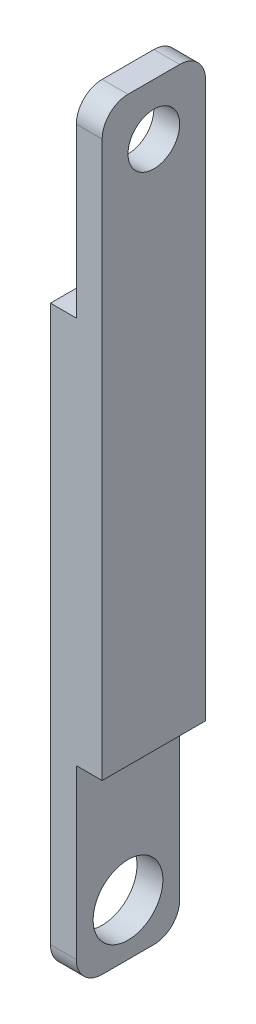
ISO-10303-21;
HEADER;
FILE_DESCRIPTION(('STEP AP214'),'2;1');
FILE_NAME('part.step','',(''),(''),'','','');
FILE_SCHEMA(('AUTOMOTIVE_DESIGN { 1 0 10303 214 1 1 1 1 }'));
ENDSEC;
DATA;
#1=APPLICATION_CONTEXT('core data for automotive mechanical design processes');
#2=APPLICATION_PROTOCOL_DEFINITION('international standard','automotive_design',2000,#1);
#3=PRODUCT_CONTEXT('',#1,'mechanical');
#4=PRODUCT('Part','Part','',(#3));
#5=PRODUCT_RELATED_PRODUCT_CATEGORY('part','',(#4));
#6=PRODUCT_DEFINITION_FORMATION('','',#4);
#7=PRODUCT_DEFINITION_CONTEXT('part definition',#1,'design');
#8=PRODUCT_DEFINITION('design','',#6,#7);
#9=PRODUCT_DEFINITION_SHAPE('','',#8);
#10=(LENGTH_UNIT() NAMED_UNIT(*) SI_UNIT(.MILLI.,.METRE.));
#11=(NAMED_UNIT(*) PLANE_ANGLE_UNIT() SI_UNIT($,.RADIAN.));
#12=(NAMED_UNIT(*) SI_UNIT($,.STERADIAN.) SOLID_ANGLE_UNIT());
#13=UNCERTAINTY_MEASURE_WITH_UNIT(LENGTH_MEASURE(1.E-05),#10,'distance_accuracy_value','');
#14=(GEOMETRIC_REPRESENTATION_CONTEXT(3) GLOBAL_UNCERTAINTY_ASSIGNED_CONTEXT((#13)) GLOBAL_UNIT_ASSIGNED_CONTEXT((#10,
#11,#12)) REPRESENTATION_CONTEXT('',''));
#15=CARTESIAN_POINT('',(0.,0.,0.));
#16=DIRECTION('',(0.,0.,1.));
#17=DIRECTION('',(1.,0.,0.));
#18=AXIS2_PLACEMENT_3D('',#15,#16,#17);
#19=CARTESIAN_POINT('',(20.,150.,20.));
#20=DIRECTION('',(0.,-1.,0.));
#21=DIRECTION('',(0.,0.,-1.));
#22=AXIS2_PLACEMENT_3D('',#19,#20,#21);
#23=PLANE('',#22);
#24=DIRECTION('',(0.,0.,1.));
#25=VECTOR('',#24,1.);
#26=CARTESIAN_POINT('',(20.,150.,20.));
#27=LINE('',#26,#25);
#28=CARTESIAN_POINT('',(20.,150.,-9.99999999999998));
#29=VERTEX_POINT('',#28);
#30=CARTESIAN_POINT('',(20.,150.,10.));
#31=VERTEX_POINT('',#30);
#32=EDGE_CURVE('E172',#29,#31,#27,.T.);
#33=ORIENTED_EDGE('',*,*,#32,.F.);
#34=DIRECTION('',(-1.,0.,0.));
#35=VECTOR('',#34,1.);
#36=CARTESIAN_POINT('',(20.,150.,-9.99999999999998));
#37=LINE('',#36,#35);
#38=CARTESIAN_POINT('',(10.,150.,-9.99999999999998));
#39=VERTEX_POINT('',#38);
#40=EDGE_CURVE('E205',#29,#39,#37,.T.);
#41=ORIENTED_EDGE('',*,*,#40,.T.);
#42=DIRECTION('',(0.,0.,-1.));
#43=VECTOR('',#42,1.);
#44=CARTESIAN_POINT('',(10.,150.,-20.));
#45=LINE('',#44,#43);
#46=CARTESIAN_POINT('',(10.,150.,10.));
#47=VERTEX_POINT('',#46);
#48=EDGE_CURVE('E160',#47,#39,#45,.T.);
#49=ORIENTED_EDGE('',*,*,#48,.F.);
#50=DIRECTION('',(-1.,0.,0.));
#51=VECTOR('',#50,1.);
#52=CARTESIAN_POINT('',(20.,150.,10.));
#53=LINE('',#52,#51);
#54=EDGE_CURVE('E47',#47,#31,#53,.F.);
#55=ORIENTED_EDGE('',*,*,#54,.T.);
#56=EDGE_LOOP('',(#33,#41,#49,#55));
#57=FACE_BOUND('',#56,.T.);
#58=ADVANCED_FACE('F32',(#57),#23,.F.);
#59=CARTESIAN_POINT('',(20.,150.,-20.));
#60=DIRECTION('',(0.,0.,1.));
#61=DIRECTION('',(0.,-1.,0.));
#62=AXIS2_PLACEMENT_3D('',#59,#60,#61);
#63=PLANE('',#62);
#64=DIRECTION('',(0.,1.,0.));
#65=VECTOR('',#64,1.);
#66=CARTESIAN_POINT('',(10.,-150.,-20.));
#67=LINE('',#66,#65);
#68=CARTESIAN_POINT('',(10.,-140.,-20.));
#69=VERTEX_POINT('',#68);
#70=CARTESIAN_POINT('',(10.,-75.,-20.));
#71=VERTEX_POINT('',#70);
#72=EDGE_CURVE('E121',#69,#71,#67,.T.);
#73=ORIENTED_EDGE('',*,*,#72,.F.);
#74=DIRECTION('',(-1.,0.,0.));
#75=VECTOR('',#74,1.);
#76=CARTESIAN_POINT('',(20.,-140.,-20.));
#77=LINE('',#76,#75);
#78=CARTESIAN_POINT('',(0.,-140.,-20.));
#79=VERTEX_POINT('',#78);
#80=EDGE_CURVE('E185',#69,#79,#77,.T.);
#81=ORIENTED_EDGE('',*,*,#80,.T.);
#82=DIRECTION('',(0.,1.,0.));
#83=VECTOR('',#82,1.);
#84=CARTESIAN_POINT('',(0.,150.,-20.));
#85=LINE('',#84,#83);
#86=CARTESIAN_POINT('',(0.,75.0000000000001,-20.));
#87=VERTEX_POINT('',#86);
#88=EDGE_CURVE('E168',#79,#87,#85,.T.);
#89=ORIENTED_EDGE('',*,*,#88,.T.);
#90=DIRECTION('',(-1.,0.,0.));
#91=VECTOR('',#90,1.);
#92=CARTESIAN_POINT('',(10.,75.0000000000001,-20.));
#93=LINE('',#92,#91);
#94=CARTESIAN_POINT('',(10.,75.0000000000001,-20.));
#95=VERTEX_POINT('',#94);
#96=EDGE_CURVE('E163',#95,#87,#93,.T.);
#97=ORIENTED_EDGE('',*,*,#96,.F.);
#98=DIRECTION('',(0.,-1.,0.));
#99=VECTOR('',#98,1.);
#100=CARTESIAN_POINT('',(10.,150.,-20.));
#101=LINE('',#100,#99);
#102=CARTESIAN_POINT('',(10.,140.,-20.));
#103=VERTEX_POINT('',#102);
#104=EDGE_CURVE('E152',#103,#95,#101,.T.);
#105=ORIENTED_EDGE('',*,*,#104,.F.);
#106=DIRECTION('',(-1.,0.,0.));
#107=VECTOR('',#106,1.);
#108=CARTESIAN_POINT('',(20.,140.,-20.));
#109=LINE('',#108,#107);
#110=CARTESIAN_POINT('',(20.,140.,-20.));
#111=VERTEX_POINT('',#110);
#112=EDGE_CURVE('E177',#103,#111,#109,.F.);
#113=ORIENTED_EDGE('',*,*,#112,.T.);
#114=DIRECTION('',(0.,1.,0.));
#115=VECTOR('',#114,1.);
#116=CARTESIAN_POINT('',(20.,150.,-20.));
#117=LINE('',#116,#115);
#118=CARTESIAN_POINT('',(20.,-75.,-20.));
#119=VERTEX_POINT('',#118);
#120=EDGE_CURVE('E146',#119,#111,#117,.T.);
#121=ORIENTED_EDGE('',*,*,#120,.F.);
#122=DIRECTION('',(1.,0.,0.));
#123=VECTOR('',#122,1.);
#124=CARTESIAN_POINT('',(10.,-75.,-20.));
#125=LINE('',#124,#123);
#126=EDGE_CURVE('E139',#71,#119,#125,.T.);
#127=ORIENTED_EDGE('',*,*,#126,.F.);
#128=EDGE_LOOP('',(#73,#81,#89,#97,#105,#113,#121,#127));
#129=FACE_BOUND('',#128,.T.);
#130=ADVANCED_FACE('F145',(#129),#63,.F.);
#131=CARTESIAN_POINT('',(20.,150.,20.));
#132=DIRECTION('',(0.,0.,-1.));
#133=DIRECTION('',(0.,1.,0.));
#134=AXIS2_PLACEMENT_3D('',#131,#132,#133);
#135=PLANE('',#134);
#136=DIRECTION('',(0.,-1.,0.));
#137=VECTOR('',#136,1.);
#138=CARTESIAN_POINT('',(0.,150.,20.));
#139=LINE('',#138,#137);
#140=CARTESIAN_POINT('',(0.,75.0000000000001,20.));
#141=VERTEX_POINT('',#140);
#142=CARTESIAN_POINT('',(0.,-140.,20.));
#143=VERTEX_POINT('',#142);
#144=EDGE_CURVE('E179',#141,#143,#139,.T.);
#145=ORIENTED_EDGE('',*,*,#144,.T.);
#146=DIRECTION('',(-1.,0.,0.));
#147=VECTOR('',#146,1.);
#148=CARTESIAN_POINT('',(20.,-140.,20.));
#149=LINE('',#148,#147);
#150=CARTESIAN_POINT('',(10.,-140.,20.));
#151=VERTEX_POINT('',#150);
#152=EDGE_CURVE('E202',#143,#151,#149,.F.);
#153=ORIENTED_EDGE('',*,*,#152,.T.);
#154=DIRECTION('',(0.,-1.,0.));
#155=VECTOR('',#154,1.);
#156=CARTESIAN_POINT('',(10.,-150.,20.));
#157=LINE('',#156,#155);
#158=CARTESIAN_POINT('',(10.,-75.,20.));
#159=VERTEX_POINT('',#158);
#160=EDGE_CURVE('E242',#159,#151,#157,.T.);
#161=ORIENTED_EDGE('',*,*,#160,.F.);
#162=DIRECTION('',(1.,0.,0.));
#163=VECTOR('',#162,1.);
#164=CARTESIAN_POINT('',(10.,-75.,20.));
#165=LINE('',#164,#163);
#166=CARTESIAN_POINT('',(20.,-75.,20.));
#167=VERTEX_POINT('',#166);
#168=EDGE_CURVE('E142',#159,#167,#165,.T.);
#169=ORIENTED_EDGE('',*,*,#168,.T.);
#170=DIRECTION('',(0.,-1.,0.));
#171=VECTOR('',#170,1.);
#172=CARTESIAN_POINT('',(20.,150.,20.));
#173=LINE('',#172,#171);
#174=CARTESIAN_POINT('',(20.,140.,20.));
#175=VERTEX_POINT('',#174);
#176=EDGE_CURVE('E175',#175,#167,#173,.T.);
#177=ORIENTED_EDGE('',*,*,#176,.F.);
#178=DIRECTION('',(-1.,0.,0.));
#179=VECTOR('',#178,1.);
#180=CARTESIAN_POINT('',(20.,140.,20.));
#181=LINE('',#180,#179);
#182=CARTESIAN_POINT('',(10.,140.,20.));
#183=VERTEX_POINT('',#182);
#184=EDGE_CURVE('E199',#175,#183,#181,.T.);
#185=ORIENTED_EDGE('',*,*,#184,.T.);
#186=DIRECTION('',(0.,1.,0.));
#187=VECTOR('',#186,1.);
#188=CARTESIAN_POINT('',(10.,150.,20.));
#189=LINE('',#188,#187);
#190=CARTESIAN_POINT('',(10.,75.0000000000001,20.));
#191=VERTEX_POINT('',#190);
#192=EDGE_CURVE('E157',#191,#183,#189,.T.);
#193=ORIENTED_EDGE('',*,*,#192,.F.);
#194=DIRECTION('',(-1.,0.,0.));
#195=VECTOR('',#194,1.);
#196=CARTESIAN_POINT('',(10.,75.0000000000001,20.));
#197=LINE('',#196,#195);
#198=EDGE_CURVE('E165',#191,#141,#197,.T.);
#199=ORIENTED_EDGE('',*,*,#198,.T.);
#200=EDGE_LOOP('',(#145,#153,#161,#169,#177,#185,#193,#199));
#201=FACE_BOUND('',#200,.T.);
#202=ADVANCED_FACE('F217',(#201),#135,.F.);
#203=CARTESIAN_POINT('',(20.,-150.,20.));
#204=DIRECTION('',(0.,1.,0.));
#205=DIRECTION('',(0.,0.,1.));
#206=AXIS2_PLACEMENT_3D('',#203,#204,#205);
#207=PLANE('',#206);
#208=DIRECTION('',(0.,0.,-1.));
#209=VECTOR('',#208,1.);
#210=CARTESIAN_POINT('',(0.,-150.,20.));
#211=LINE('',#210,#209);
#212=CARTESIAN_POINT('',(0.,-150.,9.99999999999998));
#213=VERTEX_POINT('',#212);
#214=CARTESIAN_POINT('',(0.,-150.,-10.));
#215=VERTEX_POINT('',#214);
#216=EDGE_CURVE('E173',#213,#215,#211,.T.);
#217=ORIENTED_EDGE('',*,*,#216,.T.);
#218=DIRECTION('',(-1.,0.,0.));
#219=VECTOR('',#218,1.);
#220=CARTESIAN_POINT('',(20.,-150.,-10.));
#221=LINE('',#220,#219);
#222=CARTESIAN_POINT('',(10.,-150.,-10.));
#223=VERTEX_POINT('',#222);
#224=EDGE_CURVE('E194',#215,#223,#221,.F.);
#225=ORIENTED_EDGE('',*,*,#224,.T.);
#226=DIRECTION('',(0.,0.,-1.));
#227=VECTOR('',#226,1.);
#228=CARTESIAN_POINT('',(10.,-150.,20.));
#229=LINE('',#228,#227);
#230=CARTESIAN_POINT('',(10.,-150.,9.99999999999998));
#231=VERTEX_POINT('',#230);
#232=EDGE_CURVE('E134',#231,#223,#229,.T.);
#233=ORIENTED_EDGE('',*,*,#232,.F.);
#234=DIRECTION('',(-1.,0.,0.));
#235=VECTOR('',#234,1.);
#236=CARTESIAN_POINT('',(20.,-150.,9.99999999999998));
#237=LINE('',#236,#235);
#238=EDGE_CURVE('E191',#231,#213,#237,.T.);
#239=ORIENTED_EDGE('',*,*,#238,.T.);
#240=EDGE_LOOP('',(#217,#225,#233,#239));
#241=FACE_BOUND('',#240,.T.);
#242=ADVANCED_FACE('F244',(#241),#207,.F.);
#243=CARTESIAN_POINT('',(20.,0.,0.));
#244=DIRECTION('',(1.,0.,0.));
#245=DIRECTION('',(0.,0.,-1.));
#246=AXIS2_PLACEMENT_3D('',#243,#244,#245);
#247=PLANE('',#246);
#248=CARTESIAN_POINT('',(20.,130.,0.));
#249=DIRECTION('',(1.,0.,0.));
#250=DIRECTION('',(0.,0.,-1.));
#251=AXIS2_PLACEMENT_3D('',#248,#249,#250);
#252=CIRCLE('',#251,10.);
#253=CARTESIAN_POINT('',(20.,130.,-9.99999999999999));
#254=VERTEX_POINT('',#253);
#255=EDGE_CURVE('E259',#254,#254,#252,.T.);
#256=ORIENTED_EDGE('',*,*,#255,.F.);
#257=EDGE_LOOP('',(#256));
#258=FACE_BOUND('',#257,.T.);
#259=ORIENTED_EDGE('',*,*,#120,.T.);
#260=CARTESIAN_POINT('',(20.,140.,-9.99999999999998));
#261=DIRECTION('',(1.,0.,0.));
#262=DIRECTION('',(0.,0.,-1.));
#263=AXIS2_PLACEMENT_3D('',#260,#261,#262);
#264=CIRCLE('',#263,10.);
#265=EDGE_CURVE('E11',#111,#29,#264,.T.);
#266=ORIENTED_EDGE('',*,*,#265,.T.);
#267=ORIENTED_EDGE('',*,*,#32,.T.);
#268=CARTESIAN_POINT('',(20.,140.,10.));
#269=DIRECTION('',(1.,0.,0.));
#270=DIRECTION('',(0.,0.,-1.));
#271=AXIS2_PLACEMENT_3D('',#268,#269,#270);
#272=CIRCLE('',#271,10.);
#273=EDGE_CURVE('E40',#31,#175,#272,.T.);
#274=ORIENTED_EDGE('',*,*,#273,.T.);
#275=ORIENTED_EDGE('',*,*,#176,.T.);
#276=DIRECTION('',(0.,0.,1.));
#277=VECTOR('',#276,1.);
#278=CARTESIAN_POINT('',(20.,-75.,20.));
#279=LINE('',#278,#277);
#280=EDGE_CURVE('E247',#119,#167,#279,.T.);
#281=ORIENTED_EDGE('',*,*,#280,.F.);
#282=EDGE_LOOP('',(#259,#266,#267,#274,#275,#281));
#283=FACE_BOUND('',#282,.T.);
#284=ADVANCED_FACE('F213',(#258,#283),#247,.T.);
#285=CARTESIAN_POINT('',(0.,0.,0.));
#286=DIRECTION('',(1.,0.,0.));
#287=DIRECTION('',(0.,0.,-1.));
#288=AXIS2_PLACEMENT_3D('',#285,#286,#287);
#289=PLANE('',#288);
#290=CARTESIAN_POINT('',(0.,-130.,0.));
#291=DIRECTION('',(-1.,0.,0.));
#292=DIRECTION('',(0.,0.,1.));
#293=AXIS2_PLACEMENT_3D('',#290,#291,#292);
#294=CIRCLE('',#293,13.5);
#295=CARTESIAN_POINT('',(0.,-130.,13.5));
#296=VERTEX_POINT('',#295);
#297=EDGE_CURVE('E252',#296,#296,#294,.T.);
#298=ORIENTED_EDGE('',*,*,#297,.F.);
#299=EDGE_LOOP('',(#298));
#300=FACE_BOUND('',#299,.T.);
#301=ORIENTED_EDGE('',*,*,#88,.F.);
#302=CARTESIAN_POINT('',(0.,-140.,-10.));
#303=DIRECTION('',(1.,0.,0.));
#304=DIRECTION('',(0.,0.,-1.));
#305=AXIS2_PLACEMENT_3D('',#302,#303,#304);
#306=CIRCLE('',#305,10.);
#307=EDGE_CURVE('E189',#79,#215,#306,.F.);
#308=ORIENTED_EDGE('',*,*,#307,.T.);
#309=ORIENTED_EDGE('',*,*,#216,.F.);
#310=CARTESIAN_POINT('',(0.,-140.,9.99999999999998));
#311=DIRECTION('',(1.,0.,0.));
#312=DIRECTION('',(0.,0.,-1.));
#313=AXIS2_PLACEMENT_3D('',#310,#311,#312);
#314=CIRCLE('',#313,10.);
#315=EDGE_CURVE('E187',#213,#143,#314,.F.);
#316=ORIENTED_EDGE('',*,*,#315,.T.);
#317=ORIENTED_EDGE('',*,*,#144,.F.);
#318=DIRECTION('',(0.,0.,1.));
#319=VECTOR('',#318,1.);
#320=CARTESIAN_POINT('',(0.,75.0000000000001,-20.));
#321=LINE('',#320,#319);
#322=EDGE_CURVE('E148',#87,#141,#321,.T.);
#323=ORIENTED_EDGE('',*,*,#322,.F.);
#324=EDGE_LOOP('',(#301,#308,#309,#316,#317,#323));
#325=FACE_BOUND('',#324,.T.);
#326=ADVANCED_FACE('F234',(#300,#325),#289,.F.);
#327=CARTESIAN_POINT('',(10.,75.0000000000001,-20.));
#328=DIRECTION('',(0.,-1.,0.));
#329=DIRECTION('',(0.,0.,-1.));
#330=AXIS2_PLACEMENT_3D('',#327,#328,#329);
#331=PLANE('',#330);
#332=ORIENTED_EDGE('',*,*,#322,.T.);
#333=ORIENTED_EDGE('',*,*,#198,.F.);
#334=DIRECTION('',(0.,0.,1.));
#335=VECTOR('',#334,1.);
#336=CARTESIAN_POINT('',(10.,75.0000000000001,-20.));
#337=LINE('',#336,#335);
#338=EDGE_CURVE('E154',#95,#191,#337,.T.);
#339=ORIENTED_EDGE('',*,*,#338,.F.);
#340=ORIENTED_EDGE('',*,*,#96,.T.);
#341=EDGE_LOOP('',(#332,#333,#339,#340));
#342=FACE_BOUND('',#341,.T.);
#343=ADVANCED_FACE('F231',(#342),#331,.F.);
#344=CARTESIAN_POINT('',(10.,0.,0.));
#345=DIRECTION('',(-1.,0.,0.));
#346=DIRECTION('',(0.,0.,1.));
#347=AXIS2_PLACEMENT_3D('',#344,#345,#346);
#348=PLANE('',#347);
#349=CARTESIAN_POINT('',(10.,130.,0.));
#350=DIRECTION('',(1.,0.,0.));
#351=DIRECTION('',(0.,0.,-1.));
#352=AXIS2_PLACEMENT_3D('',#349,#350,#351);
#353=CIRCLE('',#352,10.);
#354=CARTESIAN_POINT('',(10.,130.,-9.99999999999999));
#355=VERTEX_POINT('',#354);
#356=EDGE_CURVE('E257',#355,#355,#353,.T.);
#357=ORIENTED_EDGE('',*,*,#356,.T.);
#358=EDGE_LOOP('',(#357));
#359=FACE_BOUND('',#358,.T.);
#360=ORIENTED_EDGE('',*,*,#48,.T.);
#361=CARTESIAN_POINT('',(10.,140.,-9.99999999999998));
#362=DIRECTION('',(-1.,0.,0.));
#363=DIRECTION('',(0.,0.,1.));
#364=AXIS2_PLACEMENT_3D('',#361,#362,#363);
#365=CIRCLE('',#364,10.);
#366=EDGE_CURVE('E210',#39,#103,#365,.T.);
#367=ORIENTED_EDGE('',*,*,#366,.T.);
#368=ORIENTED_EDGE('',*,*,#104,.T.);
#369=ORIENTED_EDGE('',*,*,#338,.T.);
#370=ORIENTED_EDGE('',*,*,#192,.T.);
#371=CARTESIAN_POINT('',(10.,140.,10.));
#372=DIRECTION('',(-1.,0.,0.));
#373=DIRECTION('',(0.,0.,1.));
#374=AXIS2_PLACEMENT_3D('',#371,#372,#373);
#375=CIRCLE('',#374,10.);
#376=EDGE_CURVE('E208',#183,#47,#375,.T.);
#377=ORIENTED_EDGE('',*,*,#376,.T.);
#378=EDGE_LOOP('',(#360,#367,#368,#369,#370,#377));
#379=FACE_BOUND('',#378,.T.);
#380=ADVANCED_FACE('F220',(#359,#379),#348,.T.);
#381=CARTESIAN_POINT('',(10.,-75.,20.));
#382=DIRECTION('',(0.,1.,0.));
#383=DIRECTION('',(0.,0.,1.));
#384=AXIS2_PLACEMENT_3D('',#381,#382,#383);
#385=PLANE('',#384);
#386=ORIENTED_EDGE('',*,*,#280,.T.);
#387=ORIENTED_EDGE('',*,*,#168,.F.);
#388=DIRECTION('',(0.,0.,1.));
#389=VECTOR('',#388,1.);
#390=CARTESIAN_POINT('',(10.,-75.,20.));
#391=LINE('',#390,#389);
#392=EDGE_CURVE('E126',#71,#159,#391,.T.);
#393=ORIENTED_EDGE('',*,*,#392,.F.);
#394=ORIENTED_EDGE('',*,*,#126,.T.);
#395=EDGE_LOOP('',(#386,#387,#393,#394));
#396=FACE_BOUND('',#395,.T.);
#397=ADVANCED_FACE('F138',(#396),#385,.F.);
#398=CARTESIAN_POINT('',(10.,0.,0.));
#399=DIRECTION('',(-1.,0.,0.));
#400=DIRECTION('',(0.,0.,1.));
#401=AXIS2_PLACEMENT_3D('',#398,#399,#400);
#402=PLANE('',#401);
#403=CARTESIAN_POINT('',(10.,-130.,0.));
#404=DIRECTION('',(-1.,0.,0.));
#405=DIRECTION('',(0.,0.,1.));
#406=AXIS2_PLACEMENT_3D('',#403,#404,#405);
#407=CIRCLE('',#406,13.5);
#408=CARTESIAN_POINT('',(10.,-130.,13.5));
#409=VERTEX_POINT('',#408);
#410=EDGE_CURVE('E250',#409,#409,#407,.T.);
#411=ORIENTED_EDGE('',*,*,#410,.T.);
#412=EDGE_LOOP('',(#411));
#413=FACE_BOUND('',#412,.T.);
#414=ORIENTED_EDGE('',*,*,#232,.T.);
#415=CARTESIAN_POINT('',(10.,-140.,-10.));
#416=DIRECTION('',(-1.,0.,0.));
#417=DIRECTION('',(0.,0.,1.));
#418=AXIS2_PLACEMENT_3D('',#415,#416,#417);
#419=CIRCLE('',#418,10.);
#420=EDGE_CURVE('E129',#223,#69,#419,.F.);
#421=ORIENTED_EDGE('',*,*,#420,.T.);
#422=ORIENTED_EDGE('',*,*,#72,.T.);
#423=ORIENTED_EDGE('',*,*,#392,.T.);
#424=ORIENTED_EDGE('',*,*,#160,.T.);
#425=CARTESIAN_POINT('',(10.,-140.,9.99999999999998));
#426=DIRECTION('',(-1.,0.,0.));
#427=DIRECTION('',(0.,0.,1.));
#428=AXIS2_PLACEMENT_3D('',#425,#426,#427);
#429=CIRCLE('',#428,10.);
#430=EDGE_CURVE('E196',#151,#231,#429,.F.);
#431=ORIENTED_EDGE('',*,*,#430,.T.);
#432=EDGE_LOOP('',(#414,#421,#422,#423,#424,#431));
#433=FACE_BOUND('',#432,.T.);
#434=ADVANCED_FACE('F124',(#413,#433),#402,.F.);
#435=CARTESIAN_POINT('',(10.,-130.,0.));
#436=DIRECTION('',(-1.,0.,0.));
#437=DIRECTION('',(0.,0.,1.));
#438=AXIS2_PLACEMENT_3D('',#435,#436,#437);
#439=CYLINDRICAL_SURFACE('',#438,13.5);
#440=ORIENTED_EDGE('',*,*,#410,.F.);
#441=EDGE_LOOP('',(#440));
#442=FACE_BOUND('',#441,.T.);
#443=ORIENTED_EDGE('',*,*,#297,.T.);
#444=EDGE_LOOP('',(#443));
#445=FACE_BOUND('',#444,.T.);
#446=ADVANCED_FACE('F293',(#442,#445),#439,.F.);
#447=CARTESIAN_POINT('',(20.,-140.,-10.));
#448=DIRECTION('',(-1.,0.,0.));
#449=DIRECTION('',(0.,0.,1.));
#450=AXIS2_PLACEMENT_3D('',#447,#448,#449);
#451=CYLINDRICAL_SURFACE('',#450,10.);
#452=ORIENTED_EDGE('',*,*,#420,.F.);
#453=ORIENTED_EDGE('',*,*,#224,.F.);
#454=ORIENTED_EDGE('',*,*,#307,.F.);
#455=ORIENTED_EDGE('',*,*,#80,.F.);
#456=EDGE_LOOP('',(#452,#453,#454,#455));
#457=FACE_BOUND('',#456,.T.);
#458=ADVANCED_FACE('F290',(#457),#451,.T.);
#459=CARTESIAN_POINT('',(20.,-140.,9.99999999999998));
#460=DIRECTION('',(-1.,0.,0.));
#461=DIRECTION('',(0.,0.,1.));
#462=AXIS2_PLACEMENT_3D('',#459,#460,#461);
#463=CYLINDRICAL_SURFACE('',#462,10.);
#464=ORIENTED_EDGE('',*,*,#430,.F.);
#465=ORIENTED_EDGE('',*,*,#152,.F.);
#466=ORIENTED_EDGE('',*,*,#315,.F.);
#467=ORIENTED_EDGE('',*,*,#238,.F.);
#468=EDGE_LOOP('',(#464,#465,#466,#467));
#469=FACE_BOUND('',#468,.T.);
#470=ADVANCED_FACE('F239',(#469),#463,.T.);
#471=CARTESIAN_POINT('',(20.,140.,-9.99999999999998));
#472=DIRECTION('',(-1.,0.,0.));
#473=DIRECTION('',(0.,0.,1.));
#474=AXIS2_PLACEMENT_3D('',#471,#472,#473);
#475=CYLINDRICAL_SURFACE('',#474,10.);
#476=ORIENTED_EDGE('',*,*,#265,.F.);
#477=ORIENTED_EDGE('',*,*,#112,.F.);
#478=ORIENTED_EDGE('',*,*,#366,.F.);
#479=ORIENTED_EDGE('',*,*,#40,.F.);
#480=EDGE_LOOP('',(#476,#477,#478,#479));
#481=FACE_BOUND('',#480,.T.);
#482=ADVANCED_FACE('F223',(#481),#475,.T.);
#483=CARTESIAN_POINT('',(20.,140.,10.));
#484=DIRECTION('',(-1.,0.,0.));
#485=DIRECTION('',(0.,0.,1.));
#486=AXIS2_PLACEMENT_3D('',#483,#484,#485);
#487=CYLINDRICAL_SURFACE('',#486,10.);
#488=ORIENTED_EDGE('',*,*,#273,.F.);
#489=ORIENTED_EDGE('',*,*,#54,.F.);
#490=ORIENTED_EDGE('',*,*,#376,.F.);
#491=ORIENTED_EDGE('',*,*,#184,.F.);
#492=EDGE_LOOP('',(#488,#489,#490,#491));
#493=FACE_BOUND('',#492,.T.);
#494=ADVANCED_FACE('F34',(#493),#487,.T.);
#495=CARTESIAN_POINT('',(10.,130.,0.));
#496=DIRECTION('',(1.,0.,0.));
#497=DIRECTION('',(0.,0.,-1.));
#498=AXIS2_PLACEMENT_3D('',#495,#496,#497);
#499=CYLINDRICAL_SURFACE('',#498,10.);
#500=ORIENTED_EDGE('',*,*,#356,.F.);
#501=EDGE_LOOP('',(#500));
#502=FACE_BOUND('',#501,.T.);
#503=ORIENTED_EDGE('',*,*,#255,.T.);
#504=EDGE_LOOP('',(#503));
#505=FACE_BOUND('',#504,.T.);
#506=ADVANCED_FACE('F266',(#502,#505),#499,.F.);
#507=CLOSED_SHELL('',(#58,#130,#202,#242,#284,#326,#343,#380,#397,#434,#446,#458,#470,#482,#494,#506));
#508=MANIFOLD_SOLID_BREP('B2',#507);
#509=ADVANCED_BREP_SHAPE_REPRESENTATION('',(#18,#508),#14);
#510=SHAPE_DEFINITION_REPRESENTATION(#9,#509);
ENDSEC;
END-ISO-10303-21;
